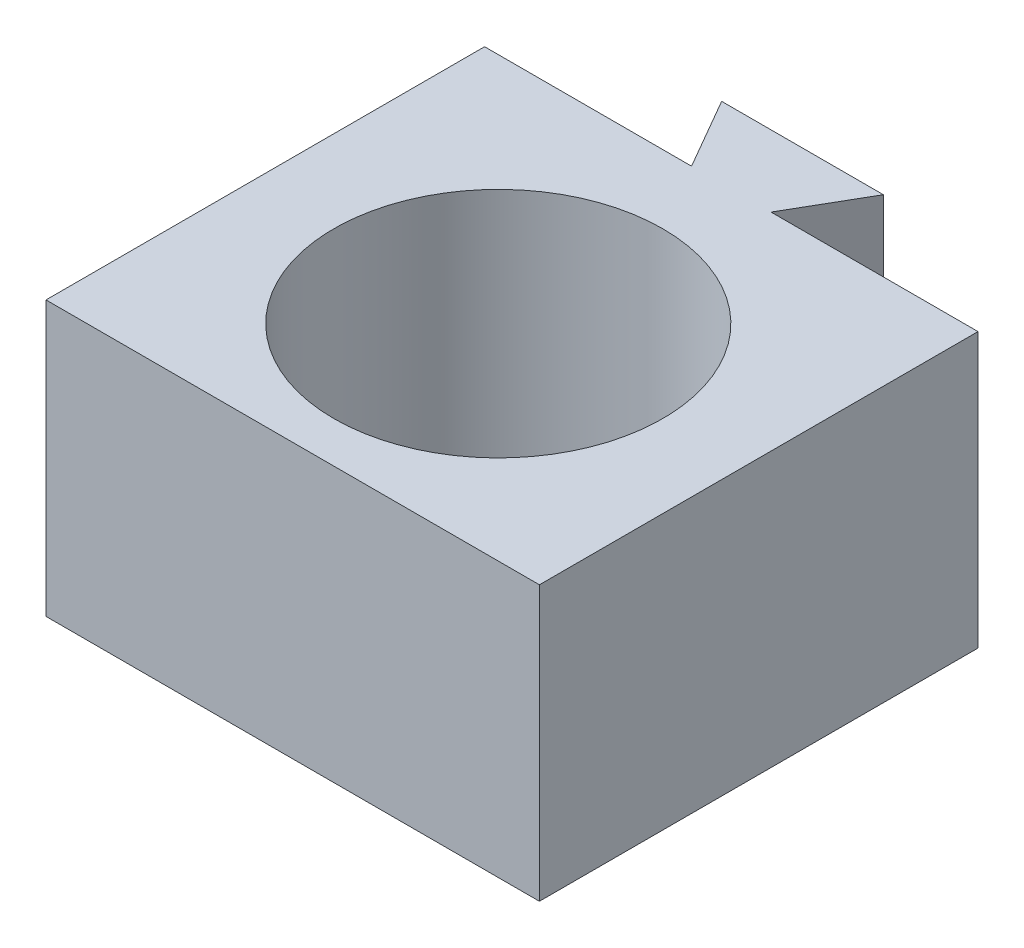
ISO-10303-21;
HEADER;
FILE_DESCRIPTION(('STEP AP214'),'2;1');
FILE_NAME('part.step','',(''),(''),'','','');
FILE_SCHEMA(('AUTOMOTIVE_DESIGN { 1 0 10303 214 1 1 1 1 }'));
ENDSEC;
DATA;
#1=APPLICATION_CONTEXT('core data for automotive mechanical design processes');
#2=APPLICATION_PROTOCOL_DEFINITION('international standard','automotive_design',2000,#1);
#3=PRODUCT_CONTEXT('',#1,'mechanical');
#4=PRODUCT('Part','Part','',(#3));
#5=PRODUCT_RELATED_PRODUCT_CATEGORY('part','',(#4));
#6=PRODUCT_DEFINITION_FORMATION('','',#4);
#7=PRODUCT_DEFINITION_CONTEXT('part definition',#1,'design');
#8=PRODUCT_DEFINITION('design','',#6,#7);
#9=PRODUCT_DEFINITION_SHAPE('','',#8);
#10=(LENGTH_UNIT() NAMED_UNIT(*) SI_UNIT(.MILLI.,.METRE.));
#11=(NAMED_UNIT(*) PLANE_ANGLE_UNIT() SI_UNIT($,.RADIAN.));
#12=(NAMED_UNIT(*) SI_UNIT($,.STERADIAN.) SOLID_ANGLE_UNIT());
#13=UNCERTAINTY_MEASURE_WITH_UNIT(LENGTH_MEASURE(1.E-05),#10,'distance_accuracy_value','');
#14=(GEOMETRIC_REPRESENTATION_CONTEXT(3) GLOBAL_UNCERTAINTY_ASSIGNED_CONTEXT((#13)) GLOBAL_UNIT_ASSIGNED_CONTEXT((#10,
#11,#12)) REPRESENTATION_CONTEXT('',''));
#15=CARTESIAN_POINT('',(0.,0.,0.));
#16=DIRECTION('',(0.,0.,1.));
#17=DIRECTION('',(1.,0.,0.));
#18=AXIS2_PLACEMENT_3D('',#15,#16,#17);
#19=CARTESIAN_POINT('',(0.,0.,0.));
#20=DIRECTION('',(0.,0.,-1.));
#21=DIRECTION('',(-1.,0.,0.));
#22=AXIS2_PLACEMENT_3D('',#19,#20,#21);
#23=PLANE('',#22);
#24=DIRECTION('',(-1.,0.,0.));
#25=VECTOR('',#24,1.);
#26=CARTESIAN_POINT('',(1.45,-3.,0.));
#27=LINE('',#26,#25);
#28=CARTESIAN_POINT('',(1.45,-3.,0.));
#29=VERTEX_POINT('',#28);
#30=CARTESIAN_POINT('',(-1.45,-3.,0.));
#31=VERTEX_POINT('',#30);
#32=EDGE_CURVE('E52',#29,#31,#27,.T.);
#33=ORIENTED_EDGE('',*,*,#32,.F.);
#34=DIRECTION('',(0.,1.,0.));
#35=VECTOR('',#34,1.);
#36=CARTESIAN_POINT('',(1.45,-11.4467045845145,0.));
#37=LINE('',#36,#35);
#38=CARTESIAN_POINT('',(1.45,5.,0.));
#39=VERTEX_POINT('',#38);
#40=EDGE_CURVE('E111',#29,#39,#37,.T.);
#41=ORIENTED_EDGE('',*,*,#40,.T.);
#42=DIRECTION('',(-1.,0.,0.));
#43=VECTOR('',#42,1.);
#44=CARTESIAN_POINT('',(-9.00000000000001,5.,0.));
#45=LINE('',#44,#43);
#46=CARTESIAN_POINT('',(8.99999999999999,5.,0.));
#47=VERTEX_POINT('',#46);
#48=EDGE_CURVE('E124',#47,#39,#45,.T.);
#49=ORIENTED_EDGE('',*,*,#48,.F.);
#50=DIRECTION('',(0.,1.,0.));
#51=VECTOR('',#50,1.);
#52=CARTESIAN_POINT('',(8.99999999999999,-5.,0.));
#53=LINE('',#52,#51);
#54=CARTESIAN_POINT('',(8.99999999999999,-5.,0.));
#55=VERTEX_POINT('',#54);
#56=EDGE_CURVE('E139',#55,#47,#53,.T.);
#57=ORIENTED_EDGE('',*,*,#56,.F.);
#58=DIRECTION('',(1.,0.,0.));
#59=VECTOR('',#58,1.);
#60=CARTESIAN_POINT('',(-9.00000000000001,-5.,0.));
#61=LINE('',#60,#59);
#62=CARTESIAN_POINT('',(-9.00000000000001,-5.,0.));
#63=VERTEX_POINT('',#62);
#64=EDGE_CURVE('E146',#63,#55,#61,.T.);
#65=ORIENTED_EDGE('',*,*,#64,.F.);
#66=DIRECTION('',(0.,-1.,0.));
#67=VECTOR('',#66,1.);
#68=CARTESIAN_POINT('',(-9.00000000000001,-5.,0.));
#69=LINE('',#68,#67);
#70=CARTESIAN_POINT('',(-9.00000000000001,5.,0.));
#71=VERTEX_POINT('',#70);
#72=EDGE_CURVE('E157',#71,#63,#69,.T.);
#73=ORIENTED_EDGE('',*,*,#72,.F.);
#74=CARTESIAN_POINT('',(-1.45,5.,0.));
#75=VERTEX_POINT('',#74);
#76=EDGE_CURVE('E155',#75,#71,#45,.T.);
#77=ORIENTED_EDGE('',*,*,#76,.F.);
#78=DIRECTION('',(0.,1.,0.));
#79=VECTOR('',#78,1.);
#80=CARTESIAN_POINT('',(-1.45,-11.4467045845145,0.));
#81=LINE('',#80,#79);
#82=EDGE_CURVE('E57',#31,#75,#81,.T.);
#83=ORIENTED_EDGE('',*,*,#82,.F.);
#84=EDGE_LOOP('',(#33,#41,#49,#57,#65,#73,#77,#83));
#85=FACE_BOUND('',#84,.T.);
#86=ADVANCED_FACE('F37',(#85),#23,.T.);
#87=CARTESIAN_POINT('',(8.99999999999999,-5.,16.));
#88=DIRECTION('',(-1.,0.,0.));
#89=DIRECTION('',(0.,0.,1.));
#90=AXIS2_PLACEMENT_3D('',#87,#88,#89);
#91=PLANE('',#90);
#92=ORIENTED_EDGE('',*,*,#56,.T.);
#93=DIRECTION('',(0.,0.,-1.));
#94=VECTOR('',#93,1.);
#95=CARTESIAN_POINT('',(8.99999999999999,5.,16.));
#96=LINE('',#95,#94);
#97=CARTESIAN_POINT('',(8.99999999999999,5.,16.));
#98=VERTEX_POINT('',#97);
#99=EDGE_CURVE('E12',#98,#47,#96,.T.);
#100=ORIENTED_EDGE('',*,*,#99,.F.);
#101=DIRECTION('',(0.,1.,0.));
#102=VECTOR('',#101,1.);
#103=CARTESIAN_POINT('',(8.99999999999999,-5.,16.));
#104=LINE('',#103,#102);
#105=CARTESIAN_POINT('',(8.99999999999999,-5.,16.));
#106=VERTEX_POINT('',#105);
#107=EDGE_CURVE('E142',#106,#98,#104,.T.);
#108=ORIENTED_EDGE('',*,*,#107,.F.);
#109=DIRECTION('',(0.,0.,-1.));
#110=VECTOR('',#109,1.);
#111=CARTESIAN_POINT('',(8.99999999999999,-5.,16.));
#112=LINE('',#111,#110);
#113=EDGE_CURVE('E152',#106,#55,#112,.T.);
#114=ORIENTED_EDGE('',*,*,#113,.T.);
#115=EDGE_LOOP('',(#92,#100,#108,#114));
#116=FACE_BOUND('',#115,.T.);
#117=ADVANCED_FACE('F39',(#116),#91,.F.);
#118=CARTESIAN_POINT('',(-9.00000000000001,5.,16.));
#119=DIRECTION('',(0.,-1.,0.));
#120=DIRECTION('',(0.,0.,-1.));
#121=AXIS2_PLACEMENT_3D('',#118,#119,#120);
#122=PLANE('',#121);
#123=CARTESIAN_POINT('',(0.,5.,8.5));
#124=DIRECTION('',(0.,1.,0.));
#125=DIRECTION('',(0.,0.,1.));
#126=AXIS2_PLACEMENT_3D('',#123,#124,#125);
#127=CIRCLE('',#126,6.);
#128=CARTESIAN_POINT('',(0.,5.,14.5));
#129=VERTEX_POINT('',#128);
#130=EDGE_CURVE('E135',#129,#129,#127,.T.);
#131=ORIENTED_EDGE('',*,*,#130,.F.);
#132=EDGE_LOOP('',(#131));
#133=FACE_BOUND('',#132,.T.);
#134=ORIENTED_EDGE('',*,*,#48,.T.);
#135=DIRECTION('',(0.500000000000004,0.,-0.866025403784436));
#136=VECTOR('',#135,1.);
#137=CARTESIAN_POINT('',(2.95,5.,-2.59807621135329));
#138=LINE('',#137,#136);
#139=CARTESIAN_POINT('',(2.95,5.,-2.59807621135329));
#140=VERTEX_POINT('',#139);
#141=EDGE_CURVE('E106',#39,#140,#138,.T.);
#142=ORIENTED_EDGE('',*,*,#141,.T.);
#143=DIRECTION('',(-1.,0.,0.));
#144=VECTOR('',#143,1.);
#145=CARTESIAN_POINT('',(-2.95,5.,-2.59807621135329));
#146=LINE('',#145,#144);
#147=CARTESIAN_POINT('',(-2.95,5.,-2.59807621135329));
#148=VERTEX_POINT('',#147);
#149=EDGE_CURVE('E114',#140,#148,#146,.T.);
#150=ORIENTED_EDGE('',*,*,#149,.T.);
#151=DIRECTION('',(0.500000000000004,0.,0.866025403784436));
#152=VECTOR('',#151,1.);
#153=CARTESIAN_POINT('',(-1.45,5.,0.));
#154=LINE('',#153,#152);
#155=EDGE_CURVE('E120',#148,#75,#154,.T.);
#156=ORIENTED_EDGE('',*,*,#155,.T.);
#157=ORIENTED_EDGE('',*,*,#76,.T.);
#158=DIRECTION('',(0.,0.,-1.));
#159=VECTOR('',#158,1.);
#160=CARTESIAN_POINT('',(-9.00000000000001,5.,16.));
#161=LINE('',#160,#159);
#162=CARTESIAN_POINT('',(-9.00000000000001,5.,16.));
#163=VERTEX_POINT('',#162);
#164=EDGE_CURVE('E45',#163,#71,#161,.T.);
#165=ORIENTED_EDGE('',*,*,#164,.F.);
#166=DIRECTION('',(-1.,0.,0.));
#167=VECTOR('',#166,1.);
#168=CARTESIAN_POINT('',(-9.00000000000001,5.,16.));
#169=LINE('',#168,#167);
#170=EDGE_CURVE('E145',#98,#163,#169,.T.);
#171=ORIENTED_EDGE('',*,*,#170,.F.);
#172=ORIENTED_EDGE('',*,*,#99,.T.);
#173=EDGE_LOOP('',(#134,#142,#150,#156,#157,#165,#171,#172));
#174=FACE_BOUND('',#173,.T.);
#175=ADVANCED_FACE('F123',(#133,#174),#122,.F.);
#176=CARTESIAN_POINT('',(-9.00000000000001,-5.,16.));
#177=DIRECTION('',(1.,0.,0.));
#178=DIRECTION('',(0.,0.,-1.));
#179=AXIS2_PLACEMENT_3D('',#176,#177,#178);
#180=PLANE('',#179);
#181=ORIENTED_EDGE('',*,*,#72,.T.);
#182=DIRECTION('',(0.,0.,-1.));
#183=VECTOR('',#182,1.);
#184=CARTESIAN_POINT('',(-9.00000000000001,-5.,16.));
#185=LINE('',#184,#183);
#186=CARTESIAN_POINT('',(-9.00000000000001,-5.,16.));
#187=VERTEX_POINT('',#186);
#188=EDGE_CURVE('E162',#187,#63,#185,.T.);
#189=ORIENTED_EDGE('',*,*,#188,.F.);
#190=DIRECTION('',(0.,-1.,0.));
#191=VECTOR('',#190,1.);
#192=CARTESIAN_POINT('',(-9.00000000000001,-5.,16.));
#193=LINE('',#192,#191);
#194=EDGE_CURVE('E148',#163,#187,#193,.T.);
#195=ORIENTED_EDGE('',*,*,#194,.F.);
#196=ORIENTED_EDGE('',*,*,#164,.T.);
#197=EDGE_LOOP('',(#181,#189,#195,#196));
#198=FACE_BOUND('',#197,.T.);
#199=ADVANCED_FACE('F169',(#198),#180,.F.);
#200=CARTESIAN_POINT('',(-9.00000000000001,-5.,16.));
#201=DIRECTION('',(0.,1.,0.));
#202=DIRECTION('',(-1.,0.,0.));
#203=AXIS2_PLACEMENT_3D('',#200,#201,#202);
#204=PLANE('',#203);
#205=CARTESIAN_POINT('',(0.,-5.,8.5));
#206=DIRECTION('',(0.,1.,0.));
#207=DIRECTION('',(0.,0.,1.));
#208=AXIS2_PLACEMENT_3D('',#205,#206,#207);
#209=CIRCLE('',#208,6.);
#210=CARTESIAN_POINT('',(0.,-5.,14.5));
#211=VERTEX_POINT('',#210);
#212=EDGE_CURVE('E136',#211,#211,#209,.T.);
#213=ORIENTED_EDGE('',*,*,#212,.T.);
#214=EDGE_LOOP('',(#213));
#215=FACE_BOUND('',#214,.T.);
#216=ORIENTED_EDGE('',*,*,#64,.T.);
#217=ORIENTED_EDGE('',*,*,#113,.F.);
#218=DIRECTION('',(1.,0.,0.));
#219=VECTOR('',#218,1.);
#220=CARTESIAN_POINT('',(-9.00000000000001,-5.,16.));
#221=LINE('',#220,#219);
#222=EDGE_CURVE('E150',#187,#106,#221,.T.);
#223=ORIENTED_EDGE('',*,*,#222,.F.);
#224=ORIENTED_EDGE('',*,*,#188,.T.);
#225=EDGE_LOOP('',(#216,#217,#223,#224));
#226=FACE_BOUND('',#225,.T.);
#227=ADVANCED_FACE('F175',(#215,#226),#204,.F.);
#228=CARTESIAN_POINT('',(0.,0.,16.));
#229=DIRECTION('',(0.,0.,-1.));
#230=DIRECTION('',(-1.,0.,0.));
#231=AXIS2_PLACEMENT_3D('',#228,#229,#230);
#232=PLANE('',#231);
#233=ORIENTED_EDGE('',*,*,#107,.T.);
#234=ORIENTED_EDGE('',*,*,#170,.T.);
#235=ORIENTED_EDGE('',*,*,#194,.T.);
#236=ORIENTED_EDGE('',*,*,#222,.T.);
#237=EDGE_LOOP('',(#233,#234,#235,#236));
#238=FACE_BOUND('',#237,.T.);
#239=ADVANCED_FACE('F181',(#238),#232,.F.);
#240=CARTESIAN_POINT('',(0.,-5.,8.5));
#241=DIRECTION('',(0.,1.,0.));
#242=DIRECTION('',(0.,0.,1.));
#243=AXIS2_PLACEMENT_3D('',#240,#241,#242);
#244=CYLINDRICAL_SURFACE('',#243,6.);
#245=ORIENTED_EDGE('',*,*,#212,.F.);
#246=EDGE_LOOP('',(#245));
#247=FACE_BOUND('',#246,.T.);
#248=ORIENTED_EDGE('',*,*,#130,.T.);
#249=EDGE_LOOP('',(#248));
#250=FACE_BOUND('',#249,.T.);
#251=ADVANCED_FACE('F183',(#247,#250),#244,.F.);
#252=CARTESIAN_POINT('',(-1.45,-11.4467045845145,0.));
#253=DIRECTION('',(-0.866025403784436,0.,0.500000000000004));
#254=DIRECTION('',(0.500000000000004,0.,0.866025403784436));
#255=AXIS2_PLACEMENT_3D('',#252,#253,#254);
#256=PLANE('',#255);
#257=DIRECTION('',(-0.500000000000004,0.,-0.866025403784436));
#258=VECTOR('',#257,1.);
#259=CARTESIAN_POINT('',(-1.45,-3.,0.));
#260=LINE('',#259,#258);
#261=CARTESIAN_POINT('',(-2.95,-3.,-2.59807621135329));
#262=VERTEX_POINT('',#261);
#263=EDGE_CURVE('E275',#31,#262,#260,.T.);
#264=ORIENTED_EDGE('',*,*,#263,.F.);
#265=ORIENTED_EDGE('',*,*,#82,.T.);
#266=ORIENTED_EDGE('',*,*,#155,.F.);
#267=DIRECTION('',(0.,1.,0.));
#268=VECTOR('',#267,1.);
#269=CARTESIAN_POINT('',(-2.95,-11.4467045845145,-2.59807621135329));
#270=LINE('',#269,#268);
#271=EDGE_CURVE('E110',#262,#148,#270,.T.);
#272=ORIENTED_EDGE('',*,*,#271,.F.);
#273=EDGE_LOOP('',(#264,#265,#266,#272));
#274=FACE_BOUND('',#273,.T.);
#275=ADVANCED_FACE('F189',(#274),#256,.T.);
#276=CARTESIAN_POINT('',(-2.95,-11.4467045845145,-2.59807621135329));
#277=DIRECTION('',(0.,0.,-1.));
#278=DIRECTION('',(-1.,0.,0.));
#279=AXIS2_PLACEMENT_3D('',#276,#277,#278);
#280=PLANE('',#279);
#281=DIRECTION('',(1.,0.,0.));
#282=VECTOR('',#281,1.);
#283=CARTESIAN_POINT('',(-2.95,-3.,-2.59807621135329));
#284=LINE('',#283,#282);
#285=CARTESIAN_POINT('',(2.95,-3.,-2.59807621135329));
#286=VERTEX_POINT('',#285);
#287=EDGE_CURVE('E131',#262,#286,#284,.T.);
#288=ORIENTED_EDGE('',*,*,#287,.F.);
#289=ORIENTED_EDGE('',*,*,#271,.T.);
#290=ORIENTED_EDGE('',*,*,#149,.F.);
#291=DIRECTION('',(0.,1.,0.));
#292=VECTOR('',#291,1.);
#293=CARTESIAN_POINT('',(2.95,-11.4467045845145,-2.59807621135329));
#294=LINE('',#293,#292);
#295=EDGE_CURVE('E101',#286,#140,#294,.T.);
#296=ORIENTED_EDGE('',*,*,#295,.F.);
#297=EDGE_LOOP('',(#288,#289,#290,#296));
#298=FACE_BOUND('',#297,.T.);
#299=ADVANCED_FACE('F115',(#298),#280,.T.);
#300=CARTESIAN_POINT('',(2.95,-11.4467045845145,-2.59807621135329));
#301=DIRECTION('',(0.866025403784436,0.,0.500000000000004));
#302=DIRECTION('',(0.500000000000004,0.,-0.866025403784436));
#303=AXIS2_PLACEMENT_3D('',#300,#301,#302);
#304=PLANE('',#303);
#305=DIRECTION('',(-0.500000000000004,0.,0.866025403784436));
#306=VECTOR('',#305,1.);
#307=CARTESIAN_POINT('',(2.95,-3.,-2.59807621135329));
#308=LINE('',#307,#306);
#309=EDGE_CURVE('E107',#286,#29,#308,.T.);
#310=ORIENTED_EDGE('',*,*,#309,.F.);
#311=ORIENTED_EDGE('',*,*,#295,.T.);
#312=ORIENTED_EDGE('',*,*,#141,.F.);
#313=ORIENTED_EDGE('',*,*,#40,.F.);
#314=EDGE_LOOP('',(#310,#311,#312,#313));
#315=FACE_BOUND('',#314,.T.);
#316=ADVANCED_FACE('F103',(#315),#304,.T.);
#317=CARTESIAN_POINT('',(-9.00000000000001,-3.,16.));
#318=DIRECTION('',(0.,1.,0.));
#319=DIRECTION('',(-1.,0.,0.));
#320=AXIS2_PLACEMENT_3D('',#317,#318,#319);
#321=PLANE('',#320);
#322=ORIENTED_EDGE('',*,*,#32,.T.);
#323=ORIENTED_EDGE('',*,*,#263,.T.);
#324=ORIENTED_EDGE('',*,*,#287,.T.);
#325=ORIENTED_EDGE('',*,*,#309,.T.);
#326=EDGE_LOOP('',(#322,#323,#324,#325));
#327=FACE_BOUND('',#326,.T.);
#328=ADVANCED_FACE('F260',(#327),#321,.F.);
#329=CLOSED_SHELL('',(#86,#117,#175,#199,#227,#239,#251,#275,#299,#316,#328));
#330=MANIFOLD_SOLID_BREP('B2',#329);
#331=ADVANCED_BREP_SHAPE_REPRESENTATION('',(#18,#330),#14);
#332=SHAPE_DEFINITION_REPRESENTATION(#9,#331);
ENDSEC;
END-ISO-10303-21;
